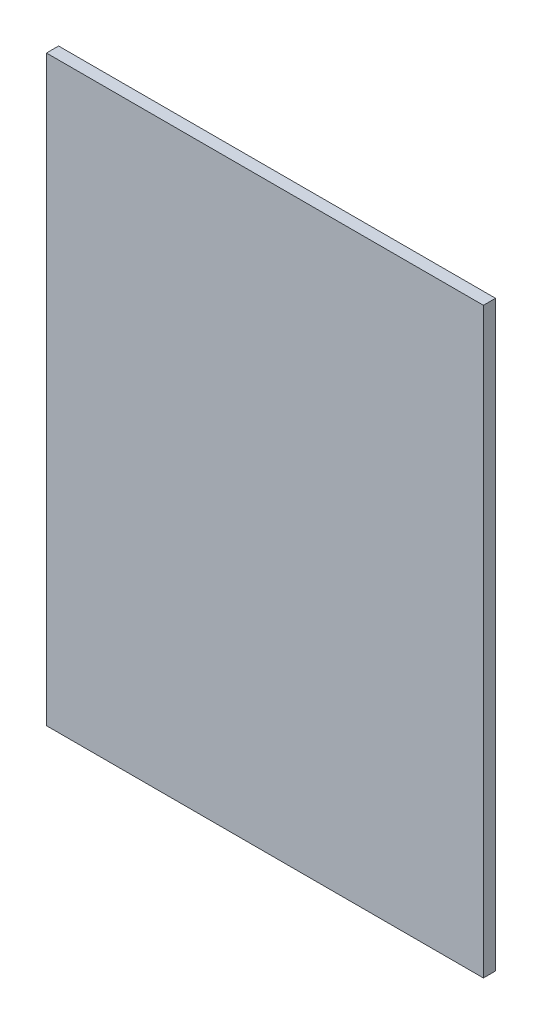
ISO-10303-21;
HEADER;
FILE_DESCRIPTION(('STEP AP214'),'2;1');
FILE_NAME('part.step','',(''),(''),'','','');
FILE_SCHEMA(('AUTOMOTIVE_DESIGN { 1 0 10303 214 1 1 1 1 }'));
ENDSEC;
DATA;
#1=APPLICATION_CONTEXT('core data for automotive mechanical design processes');
#2=APPLICATION_PROTOCOL_DEFINITION('international standard','automotive_design',2000,#1);
#3=PRODUCT_CONTEXT('',#1,'mechanical');
#4=PRODUCT('Part','Part','',(#3));
#5=PRODUCT_RELATED_PRODUCT_CATEGORY('part','',(#4));
#6=PRODUCT_DEFINITION_FORMATION('','',#4);
#7=PRODUCT_DEFINITION_CONTEXT('part definition',#1,'design');
#8=PRODUCT_DEFINITION('design','',#6,#7);
#9=PRODUCT_DEFINITION_SHAPE('','',#8);
#10=(LENGTH_UNIT() NAMED_UNIT(*) SI_UNIT(.MILLI.,.METRE.));
#11=(NAMED_UNIT(*) PLANE_ANGLE_UNIT() SI_UNIT($,.RADIAN.));
#12=(NAMED_UNIT(*) SI_UNIT($,.STERADIAN.) SOLID_ANGLE_UNIT());
#13=UNCERTAINTY_MEASURE_WITH_UNIT(LENGTH_MEASURE(1.E-05),#10,'distance_accuracy_value','');
#14=(GEOMETRIC_REPRESENTATION_CONTEXT(3) GLOBAL_UNCERTAINTY_ASSIGNED_CONTEXT((#13)) GLOBAL_UNIT_ASSIGNED_CONTEXT((#10,
#11,#12)) REPRESENTATION_CONTEXT('',''));
#15=CARTESIAN_POINT('',(0.,0.,0.));
#16=DIRECTION('',(0.,0.,1.));
#17=DIRECTION('',(1.,0.,0.));
#18=AXIS2_PLACEMENT_3D('',#15,#16,#17);
#19=CARTESIAN_POINT('',(0.,0.,25.4));
#20=DIRECTION('',(1.,0.,0.));
#21=DIRECTION('',(0.,0.,-1.));
#22=AXIS2_PLACEMENT_3D('',#19,#20,#21);
#23=PLANE('',#22);
#24=DIRECTION('',(0.,-1.,0.));
#25=VECTOR('',#24,1.);
#26=CARTESIAN_POINT('',(0.,0.,0.));
#27=LINE('',#26,#25);
#28=CARTESIAN_POINT('',(0.,0.,0.));
#29=VERTEX_POINT('',#28);
#30=CARTESIAN_POINT('',(0.,-1219.2,0.));
#31=VERTEX_POINT('',#30);
#32=EDGE_CURVE('E96',#29,#31,#27,.T.);
#33=ORIENTED_EDGE('',*,*,#32,.T.);
#34=DIRECTION('',(0.,0.,-1.));
#35=VECTOR('',#34,1.);
#36=CARTESIAN_POINT('',(0.,-1219.2,25.4));
#37=LINE('',#36,#35);
#38=CARTESIAN_POINT('',(0.,-1219.2,25.4));
#39=VERTEX_POINT('',#38);
#40=EDGE_CURVE('E11',#39,#31,#37,.T.);
#41=ORIENTED_EDGE('',*,*,#40,.F.);
#42=DIRECTION('',(0.,-1.,0.));
#43=VECTOR('',#42,1.);
#44=CARTESIAN_POINT('',(0.,0.,25.4));
#45=LINE('',#44,#43);
#46=CARTESIAN_POINT('',(0.,0.,25.4));
#47=VERTEX_POINT('',#46);
#48=EDGE_CURVE('E84',#47,#39,#45,.T.);
#49=ORIENTED_EDGE('',*,*,#48,.F.);
#50=DIRECTION('',(0.,0.,-1.));
#51=VECTOR('',#50,1.);
#52=CARTESIAN_POINT('',(0.,0.,25.4));
#53=LINE('',#52,#51);
#54=EDGE_CURVE('E92',#47,#29,#53,.T.);
#55=ORIENTED_EDGE('',*,*,#54,.T.);
#56=EDGE_LOOP('',(#33,#41,#49,#55));
#57=FACE_BOUND('',#56,.T.);
#58=ADVANCED_FACE('F33',(#57),#23,.F.);
#59=CARTESIAN_POINT('',(0.,-1219.2,25.4));
#60=DIRECTION('',(0.,1.,0.));
#61=DIRECTION('',(0.,0.,1.));
#62=AXIS2_PLACEMENT_3D('',#59,#60,#61);
#63=PLANE('',#62);
#64=DIRECTION('',(1.,0.,0.));
#65=VECTOR('',#64,1.);
#66=CARTESIAN_POINT('',(0.,-1219.2,0.));
#67=LINE('',#66,#65);
#68=CARTESIAN_POINT('',(914.4,-1219.2,0.));
#69=VERTEX_POINT('',#68);
#70=EDGE_CURVE('E88',#31,#69,#67,.T.);
#71=ORIENTED_EDGE('',*,*,#70,.T.);
#72=DIRECTION('',(0.,0.,-1.));
#73=VECTOR('',#72,1.);
#74=CARTESIAN_POINT('',(914.4,-1219.2,25.4));
#75=LINE('',#74,#73);
#76=CARTESIAN_POINT('',(914.4,-1219.2,25.4));
#77=VERTEX_POINT('',#76);
#78=EDGE_CURVE('E41',#77,#69,#75,.T.);
#79=ORIENTED_EDGE('',*,*,#78,.F.);
#80=DIRECTION('',(1.,0.,0.));
#81=VECTOR('',#80,1.);
#82=CARTESIAN_POINT('',(0.,-1219.2,25.4));
#83=LINE('',#82,#81);
#84=EDGE_CURVE('E79',#39,#77,#83,.T.);
#85=ORIENTED_EDGE('',*,*,#84,.F.);
#86=ORIENTED_EDGE('',*,*,#40,.T.);
#87=EDGE_LOOP('',(#71,#79,#85,#86));
#88=FACE_BOUND('',#87,.T.);
#89=ADVANCED_FACE('F87',(#88),#63,.F.);
#90=CARTESIAN_POINT('',(914.4,0.,25.4));
#91=DIRECTION('',(-1.,0.,0.));
#92=DIRECTION('',(0.,-1.,0.));
#93=AXIS2_PLACEMENT_3D('',#90,#91,#92);
#94=PLANE('',#93);
#95=DIRECTION('',(0.,1.,0.));
#96=VECTOR('',#95,1.);
#97=CARTESIAN_POINT('',(914.4,0.,0.));
#98=LINE('',#97,#96);
#99=CARTESIAN_POINT('',(914.4,0.,0.));
#100=VERTEX_POINT('',#99);
#101=EDGE_CURVE('E66',#69,#100,#98,.T.);
#102=ORIENTED_EDGE('',*,*,#101,.T.);
#103=DIRECTION('',(0.,0.,-1.));
#104=VECTOR('',#103,1.);
#105=CARTESIAN_POINT('',(914.4,0.,25.4));
#106=LINE('',#105,#104);
#107=CARTESIAN_POINT('',(914.4,0.,25.4));
#108=VERTEX_POINT('',#107);
#109=EDGE_CURVE('E89',#108,#100,#106,.T.);
#110=ORIENTED_EDGE('',*,*,#109,.F.);
#111=DIRECTION('',(0.,1.,0.));
#112=VECTOR('',#111,1.);
#113=CARTESIAN_POINT('',(914.4,0.,25.4));
#114=LINE('',#113,#112);
#115=EDGE_CURVE('E82',#77,#108,#114,.T.);
#116=ORIENTED_EDGE('',*,*,#115,.F.);
#117=ORIENTED_EDGE('',*,*,#78,.T.);
#118=EDGE_LOOP('',(#102,#110,#116,#117));
#119=FACE_BOUND('',#118,.T.);
#120=ADVANCED_FACE('F90',(#119),#94,.F.);
#121=CARTESIAN_POINT('',(0.,0.,25.4));
#122=DIRECTION('',(0.,-1.,0.));
#123=DIRECTION('',(0.,0.,-1.));
#124=AXIS2_PLACEMENT_3D('',#121,#122,#123);
#125=PLANE('',#124);
#126=DIRECTION('',(-1.,0.,0.));
#127=VECTOR('',#126,1.);
#128=CARTESIAN_POINT('',(0.,0.,0.));
#129=LINE('',#128,#127);
#130=EDGE_CURVE('E72',#100,#29,#129,.T.);
#131=ORIENTED_EDGE('',*,*,#130,.T.);
#132=ORIENTED_EDGE('',*,*,#54,.F.);
#133=DIRECTION('',(-1.,0.,0.));
#134=VECTOR('',#133,1.);
#135=CARTESIAN_POINT('',(0.,0.,25.4));
#136=LINE('',#135,#134);
#137=EDGE_CURVE('E49',#108,#47,#136,.T.);
#138=ORIENTED_EDGE('',*,*,#137,.F.);
#139=ORIENTED_EDGE('',*,*,#109,.T.);
#140=EDGE_LOOP('',(#131,#132,#138,#139));
#141=FACE_BOUND('',#140,.T.);
#142=ADVANCED_FACE('F103',(#141),#125,.F.);
#143=CARTESIAN_POINT('',(0.,0.,25.4));
#144=DIRECTION('',(0.,0.,1.));
#145=DIRECTION('',(1.,0.,0.));
#146=AXIS2_PLACEMENT_3D('',#143,#144,#145);
#147=PLANE('',#146);
#148=ORIENTED_EDGE('',*,*,#48,.T.);
#149=ORIENTED_EDGE('',*,*,#84,.T.);
#150=ORIENTED_EDGE('',*,*,#115,.T.);
#151=ORIENTED_EDGE('',*,*,#137,.T.);
#152=EDGE_LOOP('',(#148,#149,#150,#151));
#153=FACE_BOUND('',#152,.T.);
#154=ADVANCED_FACE('F80',(#153),#147,.T.);
#155=CARTESIAN_POINT('',(0.,0.,0.));
#156=DIRECTION('',(0.,0.,1.));
#157=DIRECTION('',(1.,0.,0.));
#158=AXIS2_PLACEMENT_3D('',#155,#156,#157);
#159=PLANE('',#158);
#160=ORIENTED_EDGE('',*,*,#32,.F.);
#161=ORIENTED_EDGE('',*,*,#130,.F.);
#162=ORIENTED_EDGE('',*,*,#101,.F.);
#163=ORIENTED_EDGE('',*,*,#70,.F.);
#164=EDGE_LOOP('',(#160,#161,#162,#163));
#165=FACE_BOUND('',#164,.T.);
#166=ADVANCED_FACE('F106',(#165),#159,.F.);
#167=CLOSED_SHELL('',(#58,#89,#120,#142,#154,#166));
#168=MANIFOLD_SOLID_BREP('B2',#167);
#169=ADVANCED_BREP_SHAPE_REPRESENTATION('',(#18,#168),#14);
#170=SHAPE_DEFINITION_REPRESENTATION(#9,#169);
ENDSEC;
END-ISO-10303-21;
